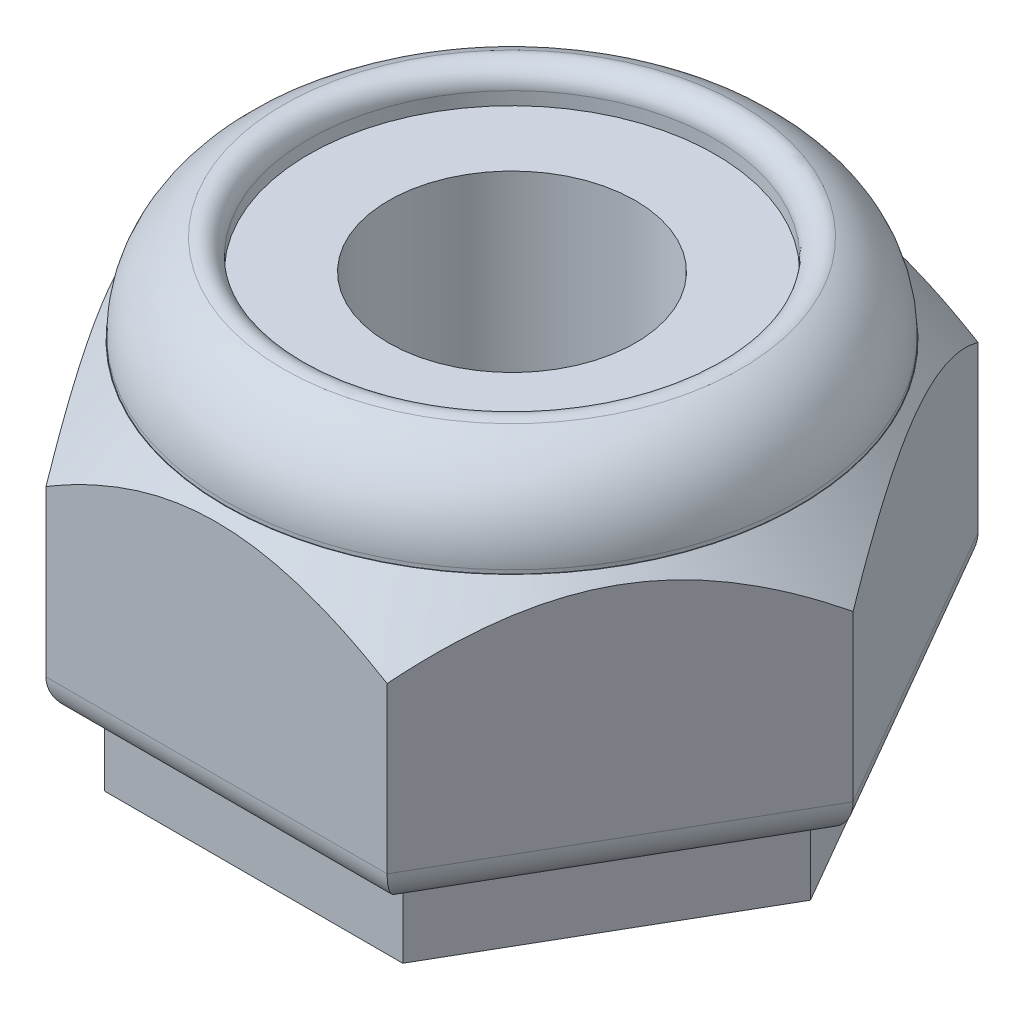
ISO-10303-21;
HEADER;
FILE_DESCRIPTION(('STEP AP214'),'2;1');
FILE_NAME('part.step','',(''),(''),'','','');
FILE_SCHEMA(('AUTOMOTIVE_DESIGN { 1 0 10303 214 1 1 1 1 }'));
ENDSEC;
DATA;
#1=APPLICATION_CONTEXT('core data for automotive mechanical design processes');
#2=APPLICATION_PROTOCOL_DEFINITION('international standard','automotive_design',2000,#1);
#3=PRODUCT_CONTEXT('',#1,'mechanical');
#4=PRODUCT('Part','Part','',(#3));
#5=PRODUCT_RELATED_PRODUCT_CATEGORY('part','',(#4));
#6=PRODUCT_DEFINITION_FORMATION('','',#4);
#7=PRODUCT_DEFINITION_CONTEXT('part definition',#1,'design');
#8=PRODUCT_DEFINITION('design','',#6,#7);
#9=PRODUCT_DEFINITION_SHAPE('','',#8);
#10=(LENGTH_UNIT() NAMED_UNIT(*) SI_UNIT(.MILLI.,.METRE.));
#11=(NAMED_UNIT(*) PLANE_ANGLE_UNIT() SI_UNIT($,.RADIAN.));
#12=(NAMED_UNIT(*) SI_UNIT($,.STERADIAN.) SOLID_ANGLE_UNIT());
#13=UNCERTAINTY_MEASURE_WITH_UNIT(LENGTH_MEASURE(1.E-05),#10,'distance_accuracy_value','');
#14=(GEOMETRIC_REPRESENTATION_CONTEXT(3) GLOBAL_UNCERTAINTY_ASSIGNED_CONTEXT((#13)) GLOBAL_UNIT_ASSIGNED_CONTEXT((#10,
#11,#12)) REPRESENTATION_CONTEXT('',''));
#15=CARTESIAN_POINT('',(0.,0.,0.));
#16=DIRECTION('',(0.,0.,1.));
#17=DIRECTION('',(1.,0.,0.));
#18=AXIS2_PLACEMENT_3D('',#15,#16,#17);
#19=CARTESIAN_POINT('',(0.,4.9784,0.));
#20=DIRECTION('',(0.,-1.,0.));
#21=DIRECTION('',(0.,0.,-1.));
#22=AXIS2_PLACEMENT_3D('',#19,#20,#21);
#23=CYLINDRICAL_SURFACE('',#22,3.937);
#24=CARTESIAN_POINT('',(0.,3.7084,0.));
#25=DIRECTION('',(0.,1.,0.));
#26=DIRECTION('',(-1.,0.,0.));
#27=AXIS2_PLACEMENT_3D('',#24,#25,#26);
#28=CIRCLE('',#27,3.937);
#29=CARTESIAN_POINT('',(-3.937,3.7084,0.));
#30=VERTEX_POINT('',#29);
#31=EDGE_CURVE('E142',#30,#30,#28,.T.);
#32=ORIENTED_EDGE('',*,*,#31,.F.);
#33=EDGE_LOOP('',(#32));
#34=FACE_BOUND('',#33,.T.);
#35=CARTESIAN_POINT('',(0.,3.6576,0.));
#36=DIRECTION('',(0.,-1.,0.));
#37=DIRECTION('',(0.,0.,-1.));
#38=AXIS2_PLACEMENT_3D('',#35,#36,#37);
#39=CIRCLE('',#38,3.937);
#40=CARTESIAN_POINT('',(0.,3.6576,-3.937));
#41=VERTEX_POINT('',#40);
#42=EDGE_CURVE('E20',#41,#41,#39,.F.);
#43=ORIENTED_EDGE('',*,*,#42,.T.);
#44=EDGE_LOOP('',(#43));
#45=FACE_BOUND('',#44,.T.);
#46=ADVANCED_FACE('F16',(#34,#45),#23,.T.);
#47=CARTESIAN_POINT('',(0.,3.7084,0.));
#48=DIRECTION('',(0.,1.,0.));
#49=DIRECTION('',(0.,0.,1.));
#50=AXIS2_PLACEMENT_3D('',#47,#48,#49);
#51=TOROIDAL_SURFACE('',#50,2.667,1.27);
#52=CARTESIAN_POINT('',(0.,4.88572150982674,0.));
#53=DIRECTION('',(0.,1.,0.));
#54=DIRECTION('',(0.,0.,1.));
#55=AXIS2_PLACEMENT_3D('',#52,#53,#54);
#56=CIRCLE('',#55,3.14325000000061);
#57=CARTESIAN_POINT('',(0.,4.88572150982674,3.14325000000061));
#58=VERTEX_POINT('',#57);
#59=EDGE_CURVE('E139',#58,#58,#56,.T.);
#60=ORIENTED_EDGE('',*,*,#59,.F.);
#61=EDGE_LOOP('',(#60));
#62=FACE_BOUND('',#61,.T.);
#63=ORIENTED_EDGE('',*,*,#31,.T.);
#64=EDGE_LOOP('',(#63));
#65=FACE_BOUND('',#64,.T.);
#66=ADVANCED_FACE('F520',(#62,#65),#51,.T.);
#67=CARTESIAN_POINT('',(2.34315,3.6576,4.05845484975428));
#68=DIRECTION('',(0.,-1.,0.));
#69=DIRECTION('',(0.,0.,-1.));
#70=AXIS2_PLACEMENT_3D('',#67,#68,#69);
#71=PLANE('',#70);
#72=CARTESIAN_POINT('',(0.,3.65760000016735,0.));
#73=DIRECTION('',(0.,-1.,0.));
#74=DIRECTION('',(0.,0.,-1.));
#75=AXIS2_PLACEMENT_3D('',#72,#73,#74);
#76=CIRCLE('',#75,3.94407100941407);
#77=CARTESIAN_POINT('',(0.,3.65760000016735,-3.94407100941407));
#78=VERTEX_POINT('',#77);
#79=EDGE_CURVE('E138',#78,#78,#76,.T.);
#80=ORIENTED_EDGE('',*,*,#79,.F.);
#81=EDGE_LOOP('',(#80));
#82=FACE_BOUND('',#81,.T.);
#83=ORIENTED_EDGE('',*,*,#42,.F.);
#84=EDGE_LOOP('',(#83));
#85=FACE_BOUND('',#84,.T.);
#86=ADVANCED_FACE('F202',(#82,#85),#71,.F.);
#87=CARTESIAN_POINT('',(0.,4.6502572078617,0.));
#88=DIRECTION('',(0.,-1.,0.));
#89=DIRECTION('',(0.,0.,-1.));
#90=AXIS2_PLACEMENT_3D('',#87,#88,#89);
#91=TOROIDAL_SURFACE('',#90,3.048,0.254);
#92=CARTESIAN_POINT('',(0.,4.6502572078617,0.));
#93=DIRECTION('',(0.,1.,0.));
#94=DIRECTION('',(0.,0.,1.));
#95=AXIS2_PLACEMENT_3D('',#92,#93,#94);
#96=CIRCLE('',#95,2.794);
#97=CARTESIAN_POINT('',(0.,4.6502572078617,2.794));
#98=VERTEX_POINT('',#97);
#99=EDGE_CURVE('E123',#98,#98,#96,.F.);
#100=ORIENTED_EDGE('',*,*,#99,.T.);
#101=EDGE_LOOP('',(#100));
#102=FACE_BOUND('',#101,.T.);
#103=ORIENTED_EDGE('',*,*,#59,.T.);
#104=EDGE_LOOP('',(#103));
#105=FACE_BOUND('',#104,.T.);
#106=ADVANCED_FACE('F18',(#102,#105),#91,.T.);
#107=CARTESIAN_POINT('',(0.,2.76773860963431,0.));
#108=DIRECTION('',(0.,-1.,0.));
#109=DIRECTION('',(0.,0.,-1.));
#110=AXIS2_PLACEMENT_3D('',#107,#108,#109);
#111=CONICAL_SURFACE('',#110,4.69075337389313,0.698131700721155);
#112=CARTESIAN_POINT('',(-4.68629999999348,2.77304593399523,3.18957668174363E-11));
#113=CARTESIAN_POINT('',(-4.65177717138756,2.81418235889058,0.0597952931853238));
#114=CARTESIAN_POINT('',(-4.61695780285874,2.85432113110325,0.120104208559187));
#115=CARTESIAN_POINT('',(-4.54666264439072,2.93230661020142,0.24185899454775));
#116=CARTESIAN_POINT('',(-4.51118655192888,2.97015222461229,0.30330538914701));
#117=CARTESIAN_POINT('',(-4.40329561885658,3.08018701499376,0.490177966906433));
#118=CARTESIAN_POINT('',(-4.32983334005873,3.1483701557544,0.617418366223026));
#119=CARTESIAN_POINT('',(-4.1797796500098,3.2709277860922,0.87731898125017));
#120=CARTESIAN_POINT('',(-4.10317943937247,3.32525984886838,1.00999443794479));
#121=CARTESIAN_POINT('',(-3.94747591658345,3.41577217647524,1.27968085033302));
#122=CARTESIAN_POINT('',(-3.8683799825187,3.45200143015516,1.4166790268052));
#123=CARTESIAN_POINT('',(-3.7374658520641,3.49372811247047,1.64342895218122));
#124=CARTESIAN_POINT('',(-3.68614686030726,3.50560413719466,1.73231605329728));
#125=CARTESIAN_POINT('',(-3.58316406721768,3.5200814070843,1.91068748323378));
#126=CARTESIAN_POINT('',(-3.53150020848239,3.52268106759525,2.00017191147836));
#127=CARTESIAN_POINT('',(-3.42855034567204,3.51847006533028,2.17848630449813));
#128=CARTESIAN_POINT('',(-3.37726380902314,3.51171021127555,2.26731719171826));
#129=CARTESIAN_POINT('',(-3.27519197727788,3.48921023566831,2.44411079032266));
#130=CARTESIAN_POINT('',(-3.22440670734793,3.47346966554293,2.53207345811744));
#131=CARTESIAN_POINT('',(-3.10963060157119,3.42817062237776,2.73087150481763));
#132=CARTESIAN_POINT('',(-3.04589899601755,3.39598542093892,2.84125788368448));
#133=CARTESIAN_POINT('',(-2.9201816676812,3.32004827868638,3.05900668375484));
#134=CARTESIAN_POINT('',(-2.85819691992543,3.27629001439926,3.16636741616216));
#135=CARTESIAN_POINT('',(-2.73588906863866,3.17910361417006,3.37821082875542));
#136=CARTESIAN_POINT('',(-2.67557364773969,3.12563730764652,3.48268020223234));
#137=CARTESIAN_POINT('',(-2.55683004359766,3.01104764647452,3.68835015768017));
#138=CARTESIAN_POINT('',(-2.49840123130636,2.94992687790312,3.78955182919461));
#139=CARTESIAN_POINT('',(-2.42439626128615,2.86741854661881,3.91773219728221));
#140=CARTESIAN_POINT('',(-2.40802320136185,2.84883596678226,3.94609116894647));
#141=CARTESIAN_POINT('',(-2.37546215779885,2.81125673922143,4.00248855074505));
#142=CARTESIAN_POINT('',(-2.35927376452174,2.79226151168798,4.0305276703939));
#143=CARTESIAN_POINT('',(-2.34315000001498,2.77304593398948,4.05845484972889));
#144=B_SPLINE_CURVE_WITH_KNOTS('',3,(#112,#113,#114,#115,#116,#117,#118,#119,#120,#121,#122,
#123,#124,#125,#126,#127,#128,#129,#130,#131,#132,#133,#134,#135,#136,#137,#138,#139,#140,#141,
#142,#143),.UNSPECIFIED.,.F.,.F.,(4,2,2,2,2,2,2,2,2,2,2,2,2,2,2,4),(0.,0.241096809056246,
0.482307589388012,0.967637153718468,1.45443592224084,1.93991010932418,2.24950193403327,
2.55914664288794,2.86711700029536,3.17510274169198,3.56882084650594,3.96275452329456,
4.35827201843946,4.75365624579551,4.86660838927403,4.97921936893793),.UNSPECIFIED.);
#145=CARTESIAN_POINT('',(-4.68629999998375,2.7730459339908,9.37515399375441E-13));
#146=VERTEX_POINT('',#145);
#147=CARTESIAN_POINT('',(-2.34314999998652,2.77304593399338,4.05845484974154));
#148=VERTEX_POINT('',#147);
#149=EDGE_CURVE('E111',#146,#148,#144,.T.);
#150=ORIENTED_EDGE('',*,*,#149,.T.);
#151=CARTESIAN_POINT('',(-2.343149999958,2.77304593399722,4.05845484975428));
#152=CARTESIAN_POINT('',(-2.27415972161835,2.81414935271739,4.05845484975427));
#153=CARTESIAN_POINT('',(-2.20457738514571,2.85425669884828,4.05845484975427));
#154=CARTESIAN_POINT('',(-2.06410193522936,2.93218331967992,4.05845484975429));
#155=CARTESIAN_POINT('',(-1.99320821637204,2.97000150131172,4.05845484975429));
#156=CARTESIAN_POINT('',(-1.77754688772133,3.07999086386102,4.05845484975426));
#157=CARTESIAN_POINT('',(-1.63068545872083,3.14815894036669,4.05845484975416));
#158=CARTESIAN_POINT('',(-1.33052752464912,3.27077676919254,4.0584548497544));
#159=CARTESIAN_POINT('',(-1.17720631618685,3.32516696804563,4.05845484975474));
#160=CARTESIAN_POINT('',(-0.865613503948554,3.4157460876751,4.05845484975382));
#161=CARTESIAN_POINT('',(-0.70735922947609,3.45199244877055,4.05845484975257));
#162=CARTESIAN_POINT('',(-0.45682214350177,3.49192146551217,4.05845484975525));
#163=CARTESIAN_POINT('',(-0.365672921281911,3.50290887300896,4.05845484975717));
#164=CARTESIAN_POINT('',(-0.183016322067624,3.51758027920104,4.0584548497514));
#165=CARTESIAN_POINT('',(-0.0915105175566495,3.52128341043656,4.05845484974374));
#166=CARTESIAN_POINT('',(0.104649468646223,3.52128177498337,4.05845484974251));
#167=CARTESIAN_POINT('',(0.209305100881576,3.51643705340262,4.05845484975112));
#168=CARTESIAN_POINT('',(0.417787181928433,3.49730239566488,4.05845484975744));
#169=CARTESIAN_POINT('',(0.521613181375682,3.48300765117544,4.05845484975513));
#170=CARTESIAN_POINT('',(0.72833254494445,3.44553375891179,4.05845484975343));
#171=CARTESIAN_POINT('',(0.831215331593288,3.42229697728581,4.05845484975405));
#172=CARTESIAN_POINT('',(1.03487580395276,3.36791830057797,4.05845484975451));
#173=CARTESIAN_POINT('',(1.13565289473255,3.33677420324107,4.05845484975434));
#174=CARTESIAN_POINT('',(1.33273383825789,3.26838741919357,4.05845484975422));
#175=CARTESIAN_POINT('',(1.42908716228577,3.23128582685647,4.05845484975426));
#176=CARTESIAN_POINT('',(1.61947291708668,3.15151071592509,4.05845484975429));
#177=CARTESIAN_POINT('',(1.71350470709066,3.10883567899735,4.05845484975428));
#178=CARTESIAN_POINT('',(1.89803195379429,3.01941532331672,4.05845484975428));
#179=CARTESIAN_POINT('',(1.98855798042342,2.9727325572595,4.05845484975428));
#180=CARTESIAN_POINT('',(2.1674283495183,2.87556944084182,4.05845484975428));
#181=CARTESIAN_POINT('',(2.25577492885003,2.82509321931918,4.05845484975428));
#182=CARTESIAN_POINT('',(2.34314999996995,2.7730459339901,4.05845484975428));
#183=B_SPLINE_CURVE_WITH_KNOTS('',3,(#151,#152,#153,#154,#155,#156,#157,#158,#159,#160,#161,
#162,#163,#164,#165,#166,#167,#168,#169,#170,#171,#172,#173,#174,#175,#176,#177,#178,#179,#180,
#181,#182),.UNSPECIFIED.,.F.,.F.,(4,2,2,2,2,2,2,2,2,2,2,2,2,2,2,4),(0.,0.240903303526745,
0.481920744670744,0.96705946683683,1.45426068355447,1.93990959151276,2.21507934679439,
2.48952538382514,2.8033759959097,3.11738642356324,3.43345557969817,3.74961286054327,
4.05916118103305,4.36879400613619,4.67425708536422,4.9793923805577),.UNSPECIFIED.);
#184=CARTESIAN_POINT('',(2.3431499999929,2.77304593399127,4.0584548497399));
#185=VERTEX_POINT('',#184);
#186=EDGE_CURVE('E103',#148,#185,#183,.T.);
#187=ORIENTED_EDGE('',*,*,#186,.T.);
#188=CARTESIAN_POINT('',(2.34315000002452,2.77304593399606,4.05845484973288));
#189=CARTESIAN_POINT('',(2.37767282861905,2.81418235889133,3.99865955657287));
#190=CARTESIAN_POINT('',(2.41249219714304,2.85432113110396,3.93835064119622));
#191=CARTESIAN_POINT('',(2.4827873556074,2.93230661020207,3.81659585520557));
#192=CARTESIAN_POINT('',(2.51826344807041,2.97015222461292,3.75514946060702));
#193=CARTESIAN_POINT('',(2.6261543811446,3.08018701499436,3.56827688284876));
#194=CARTESIAN_POINT('',(2.6996166599415,3.14837015575496,3.44103648353166));
#195=CARTESIAN_POINT('',(2.8496703499897,3.27092778609269,3.18113586850418));
#196=CARTESIAN_POINT('',(2.92627056062726,3.32525984886884,3.04846041180975));
#197=CARTESIAN_POINT('',(3.08197408341642,3.41577217647565,2.7787739994217));
#198=CARTESIAN_POINT('',(3.16107001748108,3.45200143015555,2.64177582294952));
#199=CARTESIAN_POINT('',(3.29198414793562,3.49372811247083,2.41502589757353));
#200=CARTESIAN_POINT('',(3.34330313969246,3.50560413719502,2.32613879645748));
#201=CARTESIAN_POINT('',(3.44628593278203,3.52008140708464,2.147767366521));
#202=CARTESIAN_POINT('',(3.49794979151732,3.52268106759558,2.05828293827642));
#203=CARTESIAN_POINT('',(3.60089965432767,3.5184700653306,1.87996854525667));
#204=CARTESIAN_POINT('',(3.65218619097656,3.51171021127586,1.79113765803655));
#205=CARTESIAN_POINT('',(3.75425802272181,3.48921023566861,1.61434405943216));
#206=CARTESIAN_POINT('',(3.80504329265176,3.47346966554323,1.52638139163739));
#207=CARTESIAN_POINT('',(3.91981939842849,3.42817062237805,1.32758334493721));
#208=CARTESIAN_POINT('',(3.98355100398213,3.3959854209392,1.21719696607035));
#209=CARTESIAN_POINT('',(4.10926833231848,3.32004827868664,0.999448165999992));
#210=CARTESIAN_POINT('',(4.17125308007425,3.27629001439952,0.892087433592668));
#211=CARTESIAN_POINT('',(4.29356093136102,3.1791036141703,0.680244020999412));
#212=CARTESIAN_POINT('',(4.35387635225999,3.12563730764676,0.575774647522495));
#213=CARTESIAN_POINT('',(4.47261995640202,3.01104764647474,0.37010469207467));
#214=CARTESIAN_POINT('',(4.53104876869332,2.94992687790334,0.268903020560232));
#215=CARTESIAN_POINT('',(4.60505373871337,2.86741854661919,0.140722652472905));
#216=CARTESIAN_POINT('',(4.62142679863752,2.84883596678282,0.112363680808909));
#217=CARTESIAN_POINT('',(4.65398784220021,2.81125673922235,0.0559662990108572));
#218=CARTESIAN_POINT('',(4.67017623547717,2.79226151168908,0.0279271793622662));
#219=CARTESIAN_POINT('',(4.68629999998378,2.77304593399077,2.75383844447389E-11));
#220=B_SPLINE_CURVE_WITH_KNOTS('',3,(#188,#189,#190,#191,#192,#193,#194,#195,#196,#197,#198,
#199,#200,#201,#202,#203,#204,#205,#206,#207,#208,#209,#210,#211,#212,#213,#214,#215,#216,#217,
#218,#219),.UNSPECIFIED.,.F.,.F.,(4,2,2,2,2,2,2,2,2,2,2,2,2,2,2,4),(0.,0.241096809056167,
0.482307589387856,0.967637153718162,1.45443592224038,1.93991010932357,2.24950193403264,
2.55914664288729,2.86711700029468,3.17510274169127,3.56882084650524,3.96275452329387,
4.35827201843878,4.75365624579483,4.86660838927228,4.97921936893513),.UNSPECIFIED.);
#221=CARTESIAN_POINT('',(4.68629999999161,2.77304593398144,1.33689115351009E-11));
#222=VERTEX_POINT('',#221);
#223=EDGE_CURVE('E108',#185,#222,#220,.T.);
#224=ORIENTED_EDGE('',*,*,#223,.T.);
#225=CARTESIAN_POINT('',(4.68629999999319,2.77304593399505,-3.17196911331046E-11));
#226=CARTESIAN_POINT('',(4.65177717138749,2.81418235889048,-0.0597952931852118));
#227=CARTESIAN_POINT('',(4.61695780285875,2.85432113110319,-0.120104208559102));
#228=CARTESIAN_POINT('',(4.54666264439079,2.93230661020138,-0.241858994547681));
#229=CARTESIAN_POINT('',(4.51118655192894,2.97015222461224,-0.303305389146933));
#230=CARTESIAN_POINT('',(4.40329561885661,3.0801870149937,-0.490177966906337));
#231=CARTESIAN_POINT('',(4.32983334005878,3.14837015575435,-0.617418366222931));
#232=CARTESIAN_POINT('',(4.17977965000986,3.27092778609215,-0.877318981250067));
#233=CARTESIAN_POINT('',(4.10317943937253,3.32525984886834,-1.00999443794468));
#234=CARTESIAN_POINT('',(3.94747591658352,3.41577217647521,-1.27968085033289));
#235=CARTESIAN_POINT('',(3.86837998251877,3.45200143015513,-1.41667902680507));
#236=CARTESIAN_POINT('',(3.73746585206418,3.49372811247045,-1.64342895218108));
#237=CARTESIAN_POINT('',(3.68614686030734,3.50560413719465,-1.73231605329714));
#238=CARTESIAN_POINT('',(3.58316406721777,3.52008140708429,-1.91068748323363));
#239=CARTESIAN_POINT('',(3.53150020848248,3.52268106759524,-2.00017191147821));
#240=CARTESIAN_POINT('',(3.42855034567212,3.51847006533029,-2.17848630449798));
#241=CARTESIAN_POINT('',(3.37726380902323,3.51171021127556,-2.2673171917181));
#242=CARTESIAN_POINT('',(3.27519197727797,3.48921023566833,-2.4441107903225));
#243=CARTESIAN_POINT('',(3.22440670734802,3.47346966554296,-2.53207345811728));
#244=CARTESIAN_POINT('',(3.10963060157129,3.4281706223778,-2.73087150481746));
#245=CARTESIAN_POINT('',(3.04589899601765,3.39598542093897,-2.84125788368431));
#246=CARTESIAN_POINT('',(2.92018166768131,3.32004827868645,-3.05900668375466));
#247=CARTESIAN_POINT('',(2.85819691992554,3.27629001439934,-3.16636741616197));
#248=CARTESIAN_POINT('',(2.73588906863878,3.17910361417016,-3.37821082875522));
#249=CARTESIAN_POINT('',(2.67557364773981,3.12563730764663,-3.48268020223213));
#250=CARTESIAN_POINT('',(2.55683004359779,3.01104764647465,-3.68835015767995));
#251=CARTESIAN_POINT('',(2.49840123130649,2.94992687790326,-3.78955182919438));
#252=CARTESIAN_POINT('',(2.42439626128638,2.86741854661906,-3.91773219728182));
#253=CARTESIAN_POINT('',(2.40802320136216,2.84883596678261,-3.94609116894593));
#254=CARTESIAN_POINT('',(2.37546215779933,2.81125673922199,-4.00248855074421));
#255=CARTESIAN_POINT('',(2.35927376452231,2.79226151168865,-4.03052767039292));
#256=CARTESIAN_POINT('',(2.34315000001563,2.77304593399026,-4.05845484972776));
#257=B_SPLINE_CURVE_WITH_KNOTS('',3,(#225,#226,#227,#228,#229,#230,#231,#232,#233,#234,#235,
#236,#237,#238,#239,#240,#241,#242,#243,#244,#245,#246,#247,#248,#249,#250,#251,#252,#253,#254,
#255,#256),.UNSPECIFIED.,.F.,.F.,(4,2,2,2,2,2,2,2,2,2,2,2,2,2,2,4),(0.,0.241096809056242,
0.482307589388003,0.967637153718443,1.45443592224079,1.93991010932412,2.2495019340332,
2.55914664288787,2.86711700029528,3.17510274169189,3.56882084650582,3.96275452329442,
4.35827201843928,4.7536562457953,4.86660838927321,4.97921936893651),.UNSPECIFIED.);
#258=CARTESIAN_POINT('',(2.34314999999134,2.77304593399109,-4.05845484974097));
#259=VERTEX_POINT('',#258);
#260=EDGE_CURVE('E180',#222,#259,#257,.T.);
#261=ORIENTED_EDGE('',*,*,#260,.T.);
#262=CARTESIAN_POINT('',(2.34314999996944,2.77304593399595,-4.05845484976487));
#263=CARTESIAN_POINT('',(2.27415972162791,2.81414935271385,-4.05845484975817));
#264=CARTESIAN_POINT('',(2.20457738515427,2.85425669884398,-4.05845484975534));
#265=CARTESIAN_POINT('',(2.06410193523665,2.93218331967544,-4.05845484975322));
#266=CARTESIAN_POINT('',(1.99320821637908,2.97000150130784,-4.05845484975392));
#267=CARTESIAN_POINT('',(1.77754688772728,3.07999086385858,-4.05845484975501));
#268=CARTESIAN_POINT('',(1.63068545872571,3.14815894036465,-4.05845484975436));
#269=CARTESIAN_POINT('',(1.33052752465186,3.27077676919147,-4.0584548497542));
#270=CARTESIAN_POINT('',(1.1772063161885,3.32516696804511,-4.05845484975469));
#271=CARTESIAN_POINT('',(0.865613503947962,3.41574608767532,-4.05845484975387));
#272=CARTESIAN_POINT('',(0.707359229474328,3.45199244877097,-4.05845484975258));
#273=CARTESIAN_POINT('',(0.456822143499305,3.49192146551248,-4.05845484975524));
#274=CARTESIAN_POINT('',(0.365672921279934,3.50290887300915,-4.05845484975717));
#275=CARTESIAN_POINT('',(0.183016322066631,3.51758027920108,-4.0584548497514));
#276=CARTESIAN_POINT('',(0.0915105175561532,3.52128341043657,-4.05845484974374));
#277=CARTESIAN_POINT('',(-0.104649468646221,3.52128177498337,-4.05845484974251));
#278=CARTESIAN_POINT('',(-0.209305100881572,3.51643705340262,-4.05845484975112));
#279=CARTESIAN_POINT('',(-0.417787181928427,3.49730239566488,-4.05845484975744));
#280=CARTESIAN_POINT('',(-0.521613181375675,3.48300765117544,-4.05845484975513));
#281=CARTESIAN_POINT('',(-0.728332544944443,3.44553375891179,-4.05845484975343));
#282=CARTESIAN_POINT('',(-0.831215331593282,3.42229697728581,-4.05845484975405));
#283=CARTESIAN_POINT('',(-1.03487580395276,3.36791830057797,-4.05845484975451));
#284=CARTESIAN_POINT('',(-1.13565289473255,3.33677420324107,-4.05845484975434));
#285=CARTESIAN_POINT('',(-1.33273383825789,3.26838741919357,-4.05845484975422));
#286=CARTESIAN_POINT('',(-1.42908716228577,3.23128582685647,-4.05845484975426));
#287=CARTESIAN_POINT('',(-1.61947291708668,3.15151071592509,-4.05845484975429));
#288=CARTESIAN_POINT('',(-1.71350470709067,3.10883567899735,-4.05845484975428));
#289=CARTESIAN_POINT('',(-1.8980319537943,3.01941532331672,-4.05845484975428));
#290=CARTESIAN_POINT('',(-1.98855798042343,2.9727325572595,-4.05845484975428));
#291=CARTESIAN_POINT('',(-2.1674283495183,2.87556944084182,-4.05845484975428));
#292=CARTESIAN_POINT('',(-2.25577492885003,2.82509321931918,-4.05845484975428));
#293=CARTESIAN_POINT('',(-2.34314999996995,2.7730459339901,-4.05845484975428));
#294=B_SPLINE_CURVE_WITH_KNOTS('',3,(#262,#263,#264,#265,#266,#267,#268,#269,#270,#271,#272,
#273,#274,#275,#276,#277,#278,#279,#280,#281,#282,#283,#284,#285,#286,#287,#288,#289,#290,#291,
#292,#293),.UNSPECIFIED.,.F.,.F.,(4,2,2,2,2,2,2,2,2,2,2,2,2,2,2,4),(0.,0.24090330352822,
0.481920744673772,0.967059466843218,1.45426068356448,1.93990959152627,2.21507934680641,
2.48952538383567,2.80337599592023,3.11738642357377,3.4334555797087,3.7496128605538,
4.05916118104359,4.36879400614674,4.67425708537477,4.97939238056824),.UNSPECIFIED.);
#295=CARTESIAN_POINT('',(-2.3431499999929,2.77304593399127,-4.0584548497399));
#296=VERTEX_POINT('',#295);
#297=EDGE_CURVE('E187',#259,#296,#294,.T.);
#298=ORIENTED_EDGE('',*,*,#297,.T.);
#299=CARTESIAN_POINT('',(-2.34315000002452,2.77304593399606,-4.05845484973288));
#300=CARTESIAN_POINT('',(-2.37767282861905,2.81418235889133,-3.99865955657287));
#301=CARTESIAN_POINT('',(-2.41249219714304,2.85432113110396,-3.93835064119622));
#302=CARTESIAN_POINT('',(-2.4827873556074,2.93230661020207,-3.81659585520557));
#303=CARTESIAN_POINT('',(-2.51826344807041,2.97015222461292,-3.75514946060702));
#304=CARTESIAN_POINT('',(-2.6261543811446,3.08018701499436,-3.56827688284876));
#305=CARTESIAN_POINT('',(-2.6996166599415,3.14837015575496,-3.44103648353166));
#306=CARTESIAN_POINT('',(-2.8496703499897,3.27092778609269,-3.18113586850418));
#307=CARTESIAN_POINT('',(-2.92627056062726,3.32525984886884,-3.04846041180975));
#308=CARTESIAN_POINT('',(-3.08197408341642,3.41577217647565,-2.7787739994217));
#309=CARTESIAN_POINT('',(-3.16107001748107,3.45200143015555,-2.64177582294952));
#310=CARTESIAN_POINT('',(-3.29198414793562,3.49372811247083,-2.41502589757353));
#311=CARTESIAN_POINT('',(-3.34330313969246,3.50560413719501,-2.32613879645748));
#312=CARTESIAN_POINT('',(-3.44628593278203,3.52008140708464,-2.147767366521));
#313=CARTESIAN_POINT('',(-3.49794979151732,3.52268106759558,-2.05828293827642));
#314=CARTESIAN_POINT('',(-3.60089965432767,3.5184700653306,-1.87996854525667));
#315=CARTESIAN_POINT('',(-3.65218619097656,3.51171021127586,-1.79113765803655));
#316=CARTESIAN_POINT('',(-3.75425802272181,3.48921023566861,-1.61434405943216));
#317=CARTESIAN_POINT('',(-3.80504329265176,3.47346966554323,-1.52638139163739));
#318=CARTESIAN_POINT('',(-3.91981939842849,3.42817062237805,-1.32758334493721));
#319=CARTESIAN_POINT('',(-3.98355100398213,3.3959854209392,-1.21719696607035));
#320=CARTESIAN_POINT('',(-4.10926833231848,3.32004827868664,-0.999448165999994));
#321=CARTESIAN_POINT('',(-4.17125308007425,3.27629001439952,-0.89208743359267));
#322=CARTESIAN_POINT('',(-4.29356093136102,3.1791036141703,-0.680244020999414));
#323=CARTESIAN_POINT('',(-4.35387635225999,3.12563730764676,-0.575774647522497));
#324=CARTESIAN_POINT('',(-4.47261995640202,3.01104764647475,-0.370104692074671));
#325=CARTESIAN_POINT('',(-4.53104876869332,2.94992687790334,-0.268903020560233));
#326=CARTESIAN_POINT('',(-4.60505373871344,2.86741854661911,-0.140722652472786));
#327=CARTESIAN_POINT('',(-4.62142679863765,2.84883596678266,-0.11236368080867));
#328=CARTESIAN_POINT('',(-4.65398784220049,2.81125673922203,-0.0559662990103821));
#329=CARTESIAN_POINT('',(-4.67017623547751,2.79226151168868,-0.0279271793616742));
#330=CARTESIAN_POINT('',(-4.68629999998419,2.77304593399028,-2.68308419213501E-11));
#331=B_SPLINE_CURVE_WITH_KNOTS('',3,(#299,#300,#301,#302,#303,#304,#305,#306,#307,#308,#309,
#310,#311,#312,#313,#314,#315,#316,#317,#318,#319,#320,#321,#322,#323,#324,#325,#326,#327,#328,
#329,#330),.UNSPECIFIED.,.F.,.F.,(4,2,2,2,2,2,2,2,2,2,2,2,2,2,2,4),(0.,0.241096809056167,
0.482307589387856,0.967637153718161,1.45443592224038,1.93991010932357,2.24950193403263,
2.55914664288729,2.86711700029468,3.17510274169127,3.56882084650524,3.96275452329387,
4.35827201843878,4.75365624579483,4.86660838927276,4.97921936893608),.UNSPECIFIED.);
#332=EDGE_CURVE('E212',#296,#146,#331,.T.);
#333=ORIENTED_EDGE('',*,*,#332,.T.);
#334=EDGE_LOOP('',(#150,#187,#224,#261,#298,#333));
#335=FACE_BOUND('',#334,.T.);
#336=ORIENTED_EDGE('',*,*,#79,.T.);
#337=EDGE_LOOP('',(#336));
#338=FACE_BOUND('',#337,.T.);
#339=ADVANCED_FACE('F105',(#335,#338),#111,.T.);
#340=CARTESIAN_POINT('',(0.,4.4704,0.));
#341=DIRECTION('',(0.,1.,0.));
#342=DIRECTION('',(0.,0.,1.));
#343=AXIS2_PLACEMENT_3D('',#340,#341,#342);
#344=CYLINDRICAL_SURFACE('',#343,2.794);
#345=ORIENTED_EDGE('',*,*,#99,.F.);
#346=EDGE_LOOP('',(#345));
#347=FACE_BOUND('',#346,.T.);
#348=CARTESIAN_POINT('',(0.,4.4704,0.));
#349=DIRECTION('',(0.,1.,0.));
#350=DIRECTION('',(0.,0.,1.));
#351=AXIS2_PLACEMENT_3D('',#348,#349,#350);
#352=CIRCLE('',#351,2.794);
#353=CARTESIAN_POINT('',(0.,4.4704,2.794));
#354=VERTEX_POINT('',#353);
#355=EDGE_CURVE('E176',#354,#354,#352,.T.);
#356=ORIENTED_EDGE('',*,*,#355,.F.);
#357=EDGE_LOOP('',(#356));
#358=FACE_BOUND('',#357,.T.);
#359=ADVANCED_FACE('F200',(#347,#358),#344,.F.);
#360=CARTESIAN_POINT('',(2.34315,3.6576,4.05845484975428));
#361=DIRECTION('',(-0.866025403784429,0.,-0.500000000000017));
#362=DIRECTION('',(-0.500000000000017,0.,0.866025403784429));
#363=AXIS2_PLACEMENT_3D('',#360,#361,#362);
#364=PLANE('',#363);
#365=DIRECTION('',(0.,1.,0.));
#366=VECTOR('',#365,1.);
#367=CARTESIAN_POINT('',(4.68629999999948,3.6576,-8.94818667933482E-13));
#368=LINE('',#367,#366);
#369=CARTESIAN_POINT('',(4.68629999999966,0.508,-2.24528612157613E-13));
#370=VERTEX_POINT('',#369);
#371=EDGE_CURVE('E121',#370,#222,#368,.T.);
#372=ORIENTED_EDGE('',*,*,#371,.T.);
#373=ORIENTED_EDGE('',*,*,#223,.F.);
#374=DIRECTION('',(0.,1.,0.));
#375=VECTOR('',#374,1.);
#376=CARTESIAN_POINT('',(2.34315000000748,3.6576,4.05845484975428));
#377=LINE('',#376,#375);
#378=CARTESIAN_POINT('',(2.34315000000398,0.508,4.05845484975428));
#379=VERTEX_POINT('',#378);
#380=EDGE_CURVE('E115',#185,#379,#377,.F.);
#381=ORIENTED_EDGE('',*,*,#380,.T.);
#382=DIRECTION('',(-0.500000000000017,0.,0.866025403784429));
#383=VECTOR('',#382,1.);
#384=CARTESIAN_POINT('',(2.34315000000047,0.508,4.05845484975429));
#385=LINE('',#384,#383);
#386=EDGE_CURVE('E175',#370,#379,#385,.T.);
#387=ORIENTED_EDGE('',*,*,#386,.F.);
#388=EDGE_LOOP('',(#372,#373,#381,#387));
#389=FACE_BOUND('',#388,.T.);
#390=ADVANCED_FACE('F118',(#389),#364,.F.);
#391=CARTESIAN_POINT('',(-2.34315,3.6576,4.05845484975428));
#392=DIRECTION('',(0.,0.,-1.));
#393=DIRECTION('',(-1.,0.,0.));
#394=AXIS2_PLACEMENT_3D('',#391,#392,#393);
#395=PLANE('',#394);
#396=ORIENTED_EDGE('',*,*,#380,.F.);
#397=ORIENTED_EDGE('',*,*,#186,.F.);
#398=DIRECTION('',(0.,1.,0.));
#399=VECTOR('',#398,1.);
#400=CARTESIAN_POINT('',(-2.34314999999321,3.6576,4.0584548497666));
#401=LINE('',#400,#399);
#402=CARTESIAN_POINT('',(-2.34314999999657,0.508,4.05845484976041));
#403=VERTEX_POINT('',#402);
#404=EDGE_CURVE('E131',#148,#403,#401,.F.);
#405=ORIENTED_EDGE('',*,*,#404,.T.);
#406=DIRECTION('',(-1.,0.,0.));
#407=VECTOR('',#406,1.);
#408=CARTESIAN_POINT('',(-2.34315,0.508,4.05845484975428));
#409=LINE('',#408,#407);
#410=EDGE_CURVE('E128',#379,#403,#409,.T.);
#411=ORIENTED_EDGE('',*,*,#410,.F.);
#412=EDGE_LOOP('',(#396,#397,#405,#411));
#413=FACE_BOUND('',#412,.T.);
#414=ADVANCED_FACE('F126',(#413),#395,.F.);
#415=CARTESIAN_POINT('',(-4.6863,3.6576,0.));
#416=DIRECTION('',(0.866025403784429,0.,-0.500000000000017));
#417=DIRECTION('',(-0.500000000000017,0.,-0.866025403784429));
#418=AXIS2_PLACEMENT_3D('',#415,#416,#417);
#419=PLANE('',#418);
#420=ORIENTED_EDGE('',*,*,#404,.F.);
#421=ORIENTED_EDGE('',*,*,#149,.F.);
#422=DIRECTION('',(0.,1.,0.));
#423=VECTOR('',#422,1.);
#424=CARTESIAN_POINT('',(-4.68630000000314,3.6576,5.99607169471383E-12));
#425=LINE('',#424,#423);
#426=CARTESIAN_POINT('',(-4.68630000000163,0.508,2.75502548292145E-12));
#427=VERTEX_POINT('',#426);
#428=EDGE_CURVE('E328',#146,#427,#425,.F.);
#429=ORIENTED_EDGE('',*,*,#428,.T.);
#430=DIRECTION('',(-0.500000000000017,0.,-0.866025403784429));
#431=VECTOR('',#430,1.);
#432=CARTESIAN_POINT('',(-4.68629999999971,0.508,0.));
#433=LINE('',#432,#431);
#434=EDGE_CURVE('E169',#403,#427,#433,.T.);
#435=ORIENTED_EDGE('',*,*,#434,.F.);
#436=EDGE_LOOP('',(#420,#421,#429,#435));
#437=FACE_BOUND('',#436,.T.);
#438=ADVANCED_FACE('F225',(#437),#419,.F.);
#439=CARTESIAN_POINT('',(-2.34315,3.6576,-4.05845484975428));
#440=DIRECTION('',(0.866025403784429,0.,0.500000000000017));
#441=DIRECTION('',(0.500000000000017,0.,-0.866025403784429));
#442=AXIS2_PLACEMENT_3D('',#439,#440,#441);
#443=PLANE('',#442);
#444=ORIENTED_EDGE('',*,*,#428,.F.);
#445=ORIENTED_EDGE('',*,*,#332,.F.);
#446=DIRECTION('',(0.,1.,0.));
#447=VECTOR('',#446,1.);
#448=CARTESIAN_POINT('',(-2.34315000000748,3.6576,-4.05845484975428));
#449=LINE('',#448,#447);
#450=CARTESIAN_POINT('',(-2.34315000000398,0.508,-4.05845484975428));
#451=VERTEX_POINT('',#450);
#452=EDGE_CURVE('E327',#296,#451,#449,.F.);
#453=ORIENTED_EDGE('',*,*,#452,.T.);
#454=DIRECTION('',(0.500000000000017,0.,-0.866025403784429));
#455=VECTOR('',#454,1.);
#456=CARTESIAN_POINT('',(-2.34315000000047,0.508,-4.05845484975429));
#457=LINE('',#456,#455);
#458=EDGE_CURVE('E165',#427,#451,#457,.T.);
#459=ORIENTED_EDGE('',*,*,#458,.F.);
#460=EDGE_LOOP('',(#444,#445,#453,#459));
#461=FACE_BOUND('',#460,.T.);
#462=ADVANCED_FACE('F228',(#461),#443,.F.);
#463=CARTESIAN_POINT('',(2.34315,3.6576,-4.05845484975428));
#464=DIRECTION('',(0.,0.,1.));
#465=DIRECTION('',(1.,0.,0.));
#466=AXIS2_PLACEMENT_3D('',#463,#464,#465);
#467=PLANE('',#466);
#468=ORIENTED_EDGE('',*,*,#452,.F.);
#469=ORIENTED_EDGE('',*,*,#297,.F.);
#470=DIRECTION('',(0.,1.,0.));
#471=VECTOR('',#470,1.);
#472=CARTESIAN_POINT('',(2.3431499999965,3.6576,-4.05845484976089));
#473=LINE('',#472,#471);
#474=CARTESIAN_POINT('',(2.34314999999821,0.508,-4.05845484975756));
#475=VERTEX_POINT('',#474);
#476=EDGE_CURVE('E179',#259,#475,#473,.F.);
#477=ORIENTED_EDGE('',*,*,#476,.T.);
#478=DIRECTION('',(1.,0.,0.));
#479=VECTOR('',#478,1.);
#480=CARTESIAN_POINT('',(2.34315,0.508,-4.05845484975428));
#481=LINE('',#480,#479);
#482=EDGE_CURVE('E161',#451,#475,#481,.T.);
#483=ORIENTED_EDGE('',*,*,#482,.F.);
#484=EDGE_LOOP('',(#468,#469,#477,#483));
#485=FACE_BOUND('',#484,.T.);
#486=ADVANCED_FACE('F305',(#485),#467,.F.);
#487=CARTESIAN_POINT('',(4.6863,3.6576,0.));
#488=DIRECTION('',(-0.866025403784429,0.,0.500000000000017));
#489=DIRECTION('',(0.500000000000017,0.,0.866025403784429));
#490=AXIS2_PLACEMENT_3D('',#487,#488,#489);
#491=PLANE('',#490);
#492=ORIENTED_EDGE('',*,*,#476,.F.);
#493=ORIENTED_EDGE('',*,*,#260,.F.);
#494=ORIENTED_EDGE('',*,*,#371,.F.);
#495=DIRECTION('',(0.500000000000017,0.,0.866025403784429));
#496=VECTOR('',#495,1.);
#497=CARTESIAN_POINT('',(4.68629999999971,0.508,0.));
#498=LINE('',#497,#496);
#499=EDGE_CURVE('E157',#475,#370,#498,.T.);
#500=ORIENTED_EDGE('',*,*,#499,.F.);
#501=EDGE_LOOP('',(#492,#493,#494,#500));
#502=FACE_BOUND('',#501,.T.);
#503=ADVANCED_FACE('F193',(#502),#491,.F.);
#504=CARTESIAN_POINT('',(0.,4.4704,0.));
#505=DIRECTION('',(0.,1.,0.));
#506=DIRECTION('',(0.,0.,1.));
#507=AXIS2_PLACEMENT_3D('',#504,#505,#506);
#508=PLANE('',#507);
#509=ORIENTED_EDGE('',*,*,#355,.T.);
#510=EDGE_LOOP('',(#509));
#511=FACE_BOUND('',#510,.T.);
#512=CARTESIAN_POINT('',(0.,4.4704,0.));
#513=DIRECTION('',(0.,1.,0.));
#514=DIRECTION('',(0.,0.,1.));
#515=AXIS2_PLACEMENT_3D('',#512,#513,#514);
#516=CIRCLE('',#515,1.69545);
#517=CARTESIAN_POINT('',(0.,4.4704,1.69545));
#518=VERTEX_POINT('',#517);
#519=EDGE_CURVE('E150',#518,#518,#516,.F.);
#520=ORIENTED_EDGE('',*,*,#519,.T.);
#521=EDGE_LOOP('',(#520));
#522=FACE_BOUND('',#521,.T.);
#523=ADVANCED_FACE('F298',(#511,#522),#508,.T.);
#524=CARTESIAN_POINT('',(1.90320909487798,0.508,3.80445484975428));
#525=DIRECTION('',(-0.500000000000017,0.,0.866025403784429));
#526=DIRECTION('',(0.866025403784429,0.,0.500000000000017));
#527=AXIS2_PLACEMENT_3D('',#524,#525,#526);
#528=CYLINDRICAL_SURFACE('',#527,0.508);
#529=CARTESIAN_POINT('',(2.04985606325215,0.508,3.55045484975428));
#530=DIRECTION('',(-0.866025403784443,0.,0.499999999999992));
#531=DIRECTION('',(-0.499999999999992,0.,-0.866025403784444));
#532=AXIS2_PLACEMENT_3D('',#529,#530,#531);
#533=ELLIPSE('',#532,0.586587873496657,0.508);
#534=CARTESIAN_POINT('',(2.04985606325175,0.,3.55045484975405));
#535=VERTEX_POINT('',#534);
#536=EDGE_CURVE('E173',#535,#379,#533,.T.);
#537=ORIENTED_EDGE('',*,*,#536,.F.);
#538=DIRECTION('',(-0.500000000000017,0.,0.866025403784429));
#539=VECTOR('',#538,1.);
#540=CARTESIAN_POINT('',(4.09971212650296,0.,0.));
#541=LINE('',#540,#539);
#542=CARTESIAN_POINT('',(4.09971212650294,0.,0.));
#543=VERTEX_POINT('',#542);
#544=EDGE_CURVE('E153',#535,#543,#541,.F.);
#545=ORIENTED_EDGE('',*,*,#544,.T.);
#546=CARTESIAN_POINT('',(4.09971212650327,0.508,3.82289686018389E-13));
#547=DIRECTION('',(0.,0.,1.));
#548=DIRECTION('',(1.,0.,0.));
#549=AXIS2_PLACEMENT_3D('',#546,#547,#548);
#550=ELLIPSE('',#549,0.586587873496666,0.508);
#551=EDGE_CURVE('E154',#370,#543,#550,.F.);
#552=ORIENTED_EDGE('',*,*,#551,.F.);
#553=ORIENTED_EDGE('',*,*,#386,.T.);
#554=EDGE_LOOP('',(#537,#545,#552,#553));
#555=FACE_BOUND('',#554,.T.);
#556=ADVANCED_FACE('F295',(#555),#528,.T.);
#557=CARTESIAN_POINT('',(-2.34315,0.508,3.55045484975428));
#558=DIRECTION('',(-1.,0.,0.));
#559=DIRECTION('',(0.,0.,1.));
#560=AXIS2_PLACEMENT_3D('',#557,#558,#559);
#561=CYLINDRICAL_SURFACE('',#560,0.508);
#562=ORIENTED_EDGE('',*,*,#536,.T.);
#563=ORIENTED_EDGE('',*,*,#410,.T.);
#564=CARTESIAN_POINT('',(-2.04985606325171,0.508,3.55045484975428));
#565=DIRECTION('',(-0.866025403784443,0.,-0.499999999999992));
#566=DIRECTION('',(0.499999999999992,0.,-0.866025403784444));
#567=AXIS2_PLACEMENT_3D('',#564,#565,#566);
#568=ELLIPSE('',#567,0.586587873496657,0.508);
#569=CARTESIAN_POINT('',(-2.04985606325185,0.,3.55045484975428));
#570=VERTEX_POINT('',#569);
#571=EDGE_CURVE('E170',#570,#403,#568,.T.);
#572=ORIENTED_EDGE('',*,*,#571,.F.);
#573=DIRECTION('',(-1.,0.,0.));
#574=VECTOR('',#573,1.);
#575=CARTESIAN_POINT('',(2.04985606325199,0.,3.55045484975428));
#576=LINE('',#575,#574);
#577=EDGE_CURVE('E351',#570,#535,#576,.F.);
#578=ORIENTED_EDGE('',*,*,#577,.T.);
#579=EDGE_LOOP('',(#562,#563,#572,#578));
#580=FACE_BOUND('',#579,.T.);
#581=ADVANCED_FACE('F291',(#580),#561,.T.);
#582=CARTESIAN_POINT('',(-4.24635909487722,0.508,-0.254));
#583=DIRECTION('',(-0.500000000000017,0.,-0.866025403784429));
#584=DIRECTION('',(-0.866025403784429,0.,0.500000000000017));
#585=AXIS2_PLACEMENT_3D('',#582,#583,#584);
#586=CYLINDRICAL_SURFACE('',#585,0.508);
#587=ORIENTED_EDGE('',*,*,#571,.T.);
#588=ORIENTED_EDGE('',*,*,#434,.T.);
#589=CARTESIAN_POINT('',(-4.09971212650327,0.508,-3.83238362919314E-13));
#590=DIRECTION('',(0.,0.,-1.));
#591=DIRECTION('',(1.,0.,0.));
#592=AXIS2_PLACEMENT_3D('',#589,#590,#591);
#593=ELLIPSE('',#592,0.586587873496666,0.508);
#594=CARTESIAN_POINT('',(-4.09971212650334,0.,0.));
#595=VERTEX_POINT('',#594);
#596=EDGE_CURVE('E166',#595,#427,#593,.T.);
#597=ORIENTED_EDGE('',*,*,#596,.F.);
#598=DIRECTION('',(-0.500000000000017,0.,-0.866025403784429));
#599=VECTOR('',#598,1.);
#600=CARTESIAN_POINT('',(-2.04985606325199,0.,3.55045484975428));
#601=LINE('',#600,#599);
#602=EDGE_CURVE('E340',#595,#570,#601,.F.);
#603=ORIENTED_EDGE('',*,*,#602,.T.);
#604=EDGE_LOOP('',(#587,#588,#597,#603));
#605=FACE_BOUND('',#604,.T.);
#606=ADVANCED_FACE('F287',(#605),#586,.T.);
#607=CARTESIAN_POINT('',(-1.90320909487798,0.508,-3.80445484975428));
#608=DIRECTION('',(0.500000000000017,0.,-0.866025403784429));
#609=DIRECTION('',(-0.866025403784429,0.,-0.500000000000017));
#610=AXIS2_PLACEMENT_3D('',#607,#608,#609);
#611=CYLINDRICAL_SURFACE('',#610,0.508);
#612=ORIENTED_EDGE('',*,*,#596,.T.);
#613=ORIENTED_EDGE('',*,*,#458,.T.);
#614=CARTESIAN_POINT('',(-2.04985606325215,0.508,-3.55045484975428));
#615=DIRECTION('',(0.866025403784443,0.,-0.499999999999992));
#616=DIRECTION('',(0.499999999999992,0.,0.866025403784444));
#617=AXIS2_PLACEMENT_3D('',#614,#615,#616);
#618=ELLIPSE('',#617,0.586587873496657,0.508);
#619=CARTESIAN_POINT('',(-2.04985606325175,0.,-3.55045484975405));
#620=VERTEX_POINT('',#619);
#621=EDGE_CURVE('E162',#620,#451,#618,.T.);
#622=ORIENTED_EDGE('',*,*,#621,.F.);
#623=DIRECTION('',(0.500000000000017,0.,-0.866025403784429));
#624=VECTOR('',#623,1.);
#625=CARTESIAN_POINT('',(-4.09971212650296,0.,0.));
#626=LINE('',#625,#624);
#627=EDGE_CURVE('E390',#620,#595,#626,.F.);
#628=ORIENTED_EDGE('',*,*,#627,.T.);
#629=EDGE_LOOP('',(#612,#613,#622,#628));
#630=FACE_BOUND('',#629,.T.);
#631=ADVANCED_FACE('F283',(#630),#611,.T.);
#632=CARTESIAN_POINT('',(2.34315,0.508,-3.55045484975428));
#633=DIRECTION('',(1.,0.,0.));
#634=DIRECTION('',(0.,0.,-1.));
#635=AXIS2_PLACEMENT_3D('',#632,#633,#634);
#636=CYLINDRICAL_SURFACE('',#635,0.508);
#637=ORIENTED_EDGE('',*,*,#621,.T.);
#638=ORIENTED_EDGE('',*,*,#482,.T.);
#639=CARTESIAN_POINT('',(2.04985606325171,0.508,-3.55045484975428));
#640=DIRECTION('',(0.866025403784443,0.,0.499999999999992));
#641=DIRECTION('',(-0.499999999999992,0.,0.866025403784444));
#642=AXIS2_PLACEMENT_3D('',#639,#640,#641);
#643=ELLIPSE('',#642,0.586587873496657,0.508);
#644=CARTESIAN_POINT('',(2.04985606325185,0.,-3.55045484975428));
#645=VERTEX_POINT('',#644);
#646=EDGE_CURVE('E158',#645,#475,#643,.T.);
#647=ORIENTED_EDGE('',*,*,#646,.F.);
#648=DIRECTION('',(1.,0.,0.));
#649=VECTOR('',#648,1.);
#650=CARTESIAN_POINT('',(-2.04985606325199,0.,-3.55045484975428));
#651=LINE('',#650,#649);
#652=EDGE_CURVE('E380',#645,#620,#651,.F.);
#653=ORIENTED_EDGE('',*,*,#652,.T.);
#654=EDGE_LOOP('',(#637,#638,#647,#653));
#655=FACE_BOUND('',#654,.T.);
#656=ADVANCED_FACE('F279',(#655),#636,.T.);
#657=CARTESIAN_POINT('',(4.24635909487722,0.508,0.254));
#658=DIRECTION('',(0.500000000000017,0.,0.866025403784429));
#659=DIRECTION('',(0.866025403784429,0.,-0.500000000000017));
#660=AXIS2_PLACEMENT_3D('',#657,#658,#659);
#661=CYLINDRICAL_SURFACE('',#660,0.508);
#662=ORIENTED_EDGE('',*,*,#551,.T.);
#663=DIRECTION('',(0.500000000000017,0.,0.866025403784429));
#664=VECTOR('',#663,1.);
#665=CARTESIAN_POINT('',(2.04985606325199,0.,-3.55045484975428));
#666=LINE('',#665,#664);
#667=EDGE_CURVE('E149',#543,#645,#666,.F.);
#668=ORIENTED_EDGE('',*,*,#667,.T.);
#669=ORIENTED_EDGE('',*,*,#646,.T.);
#670=ORIENTED_EDGE('',*,*,#499,.T.);
#671=EDGE_LOOP('',(#662,#668,#669,#670));
#672=FACE_BOUND('',#671,.T.);
#673=ADVANCED_FACE('F275',(#672),#661,.T.);
#674=CARTESIAN_POINT('',(0.,0.,0.));
#675=DIRECTION('',(0.,1.,0.));
#676=DIRECTION('',(0.,0.,1.));
#677=AXIS2_PLACEMENT_3D('',#674,#675,#676);
#678=CYLINDRICAL_SURFACE('',#677,1.69545);
#679=ORIENTED_EDGE('',*,*,#519,.F.);
#680=EDGE_LOOP('',(#679));
#681=FACE_BOUND('',#680,.T.);
#682=CARTESIAN_POINT('',(0.,-0.95631,0.));
#683=DIRECTION('',(0.,1.,0.));
#684=DIRECTION('',(0.,0.,1.));
#685=AXIS2_PLACEMENT_3D('',#682,#683,#684);
#686=CIRCLE('',#685,1.69545);
#687=CARTESIAN_POINT('',(0.,-0.95631,1.69545));
#688=VERTEX_POINT('',#687);
#689=EDGE_CURVE('E145',#688,#688,#686,.T.);
#690=ORIENTED_EDGE('',*,*,#689,.F.);
#691=EDGE_LOOP('',(#690));
#692=FACE_BOUND('',#691,.T.);
#693=ADVANCED_FACE('F271',(#681,#692),#678,.F.);
#694=CARTESIAN_POINT('',(4.09971212650296,-0.95631,0.));
#695=DIRECTION('',(-0.866025403784429,0.,-0.500000000000017));
#696=DIRECTION('',(-0.500000000000017,0.,0.866025403784429));
#697=AXIS2_PLACEMENT_3D('',#694,#695,#696);
#698=PLANE('',#697);
#699=DIRECTION('',(0.,1.,0.));
#700=VECTOR('',#699,1.);
#701=CARTESIAN_POINT('',(2.04985606325175,-0.95631,3.55045484975428));
#702=LINE('',#701,#700);
#703=CARTESIAN_POINT('',(2.04985606325171,-0.95631,3.55045484975426));
#704=VERTEX_POINT('',#703);
#705=EDGE_CURVE('E353',#535,#704,#702,.F.);
#706=ORIENTED_EDGE('',*,*,#705,.T.);
#707=DIRECTION('',(-0.500000000000023,0.,0.866025403784425));
#708=VECTOR('',#707,1.);
#709=CARTESIAN_POINT('',(4.0997121265031,-0.95631,0.));
#710=LINE('',#709,#708);
#711=CARTESIAN_POINT('',(4.09971212650323,-0.95631,-1.58293517182884E-13));
#712=VERTEX_POINT('',#711);
#713=EDGE_CURVE('E148',#712,#704,#710,.T.);
#714=ORIENTED_EDGE('',*,*,#713,.F.);
#715=DIRECTION('',(0.,1.,0.));
#716=VECTOR('',#715,1.);
#717=CARTESIAN_POINT('',(4.09971212650323,-0.95631,-1.58293517182884E-13));
#718=LINE('',#717,#716);
#719=EDGE_CURVE('E406',#712,#543,#718,.T.);
#720=ORIENTED_EDGE('',*,*,#719,.T.);
#721=ORIENTED_EDGE('',*,*,#544,.F.);
#722=EDGE_LOOP('',(#706,#714,#720,#721));
#723=FACE_BOUND('',#722,.T.);
#724=ADVANCED_FACE('F267',(#723),#698,.F.);
#725=CARTESIAN_POINT('',(2.04985606325199,-0.95631,3.55045484975428));
#726=DIRECTION('',(0.,0.,-1.));
#727=DIRECTION('',(-1.,0.,0.));
#728=AXIS2_PLACEMENT_3D('',#725,#726,#727);
#729=PLANE('',#728);
#730=DIRECTION('',(0.,1.,0.));
#731=VECTOR('',#730,1.);
#732=CARTESIAN_POINT('',(-2.04985606325192,-0.95631,3.5504548497544));
#733=LINE('',#732,#731);
#734=CARTESIAN_POINT('',(-2.04985606325195,-0.95631,3.55045484975435));
#735=VERTEX_POINT('',#734);
#736=EDGE_CURVE('E344',#570,#735,#733,.F.);
#737=ORIENTED_EDGE('',*,*,#736,.T.);
#738=DIRECTION('',(1.,0.,0.));
#739=VECTOR('',#738,1.);
#740=CARTESIAN_POINT('',(-4.09971212650296,-0.95631,3.55045484975426));
#741=LINE('',#740,#739);
#742=EDGE_CURVE('E359',#704,#735,#741,.F.);
#743=ORIENTED_EDGE('',*,*,#742,.F.);
#744=ORIENTED_EDGE('',*,*,#705,.F.);
#745=ORIENTED_EDGE('',*,*,#577,.F.);
#746=EDGE_LOOP('',(#737,#743,#744,#745));
#747=FACE_BOUND('',#746,.T.);
#748=ADVANCED_FACE('F263',(#747),#729,.F.);
#749=CARTESIAN_POINT('',(-2.04985606325199,-0.95631,3.55045484975428));
#750=DIRECTION('',(0.866025403784429,0.,-0.500000000000017));
#751=DIRECTION('',(-0.500000000000017,0.,-0.866025403784429));
#752=AXIS2_PLACEMENT_3D('',#749,#750,#751);
#753=PLANE('',#752);
#754=DIRECTION('',(0.,1.,0.));
#755=VECTOR('',#754,1.);
#756=CARTESIAN_POINT('',(-4.09971212650284,-0.95631,-2.08341690135683E-13));
#757=LINE('',#756,#755);
#758=CARTESIAN_POINT('',(-4.09971212650293,-0.95631,0.));
#759=VERTEX_POINT('',#758);
#760=EDGE_CURVE('E343',#595,#759,#757,.F.);
#761=ORIENTED_EDGE('',*,*,#760,.T.);
#762=DIRECTION('',(-0.500000000000004,0.,-0.866025403784436));
#763=VECTOR('',#762,1.);
#764=CARTESIAN_POINT('',(-2.04985606325199,-0.95631,3.55045484975428));
#765=LINE('',#764,#763);
#766=EDGE_CURVE('E348',#735,#759,#765,.T.);
#767=ORIENTED_EDGE('',*,*,#766,.F.);
#768=ORIENTED_EDGE('',*,*,#736,.F.);
#769=ORIENTED_EDGE('',*,*,#602,.F.);
#770=EDGE_LOOP('',(#761,#767,#768,#769));
#771=FACE_BOUND('',#770,.T.);
#772=ADVANCED_FACE('F259',(#771),#753,.F.);
#773=CARTESIAN_POINT('',(-4.09971212650296,-0.95631,0.));
#774=DIRECTION('',(0.866025403784429,0.,0.500000000000017));
#775=DIRECTION('',(0.500000000000017,0.,-0.866025403784429));
#776=AXIS2_PLACEMENT_3D('',#773,#774,#775);
#777=PLANE('',#776);
#778=DIRECTION('',(0.,1.,0.));
#779=VECTOR('',#778,1.);
#780=CARTESIAN_POINT('',(-2.04985606325175,-0.95631,-3.55045484975428));
#781=LINE('',#780,#779);
#782=CARTESIAN_POINT('',(-2.04985606325172,-0.95631,-3.55045484975427));
#783=VERTEX_POINT('',#782);
#784=EDGE_CURVE('E383',#620,#783,#781,.F.);
#785=ORIENTED_EDGE('',*,*,#784,.T.);
#786=DIRECTION('',(0.499999999999995,0.,-0.866025403784442));
#787=VECTOR('',#786,1.);
#788=CARTESIAN_POINT('',(-4.09971212650308,-0.95631,3.13647043514311E-13));
#789=LINE('',#788,#787);
#790=EDGE_CURVE('E385',#759,#783,#789,.T.);
#791=ORIENTED_EDGE('',*,*,#790,.F.);
#792=ORIENTED_EDGE('',*,*,#760,.F.);
#793=ORIENTED_EDGE('',*,*,#627,.F.);
#794=EDGE_LOOP('',(#785,#791,#792,#793));
#795=FACE_BOUND('',#794,.T.);
#796=ADVANCED_FACE('F256',(#795),#777,.F.);
#797=CARTESIAN_POINT('',(-2.04985606325199,-0.95631,-3.55045484975428));
#798=DIRECTION('',(0.,0.,1.));
#799=DIRECTION('',(1.,0.,0.));
#800=AXIS2_PLACEMENT_3D('',#797,#798,#799);
#801=PLANE('',#800);
#802=DIRECTION('',(0.,1.,0.));
#803=VECTOR('',#802,1.);
#804=CARTESIAN_POINT('',(2.04985606325195,-0.95631,-3.55045484975434));
#805=LINE('',#804,#803);
#806=CARTESIAN_POINT('',(2.04985606325197,-0.95631,-3.55045484975431));
#807=VERTEX_POINT('',#806);
#808=EDGE_CURVE('E35',#645,#807,#805,.F.);
#809=ORIENTED_EDGE('',*,*,#808,.T.);
#810=DIRECTION('',(1.,0.,0.));
#811=VECTOR('',#810,1.);
#812=CARTESIAN_POINT('',(-4.09971212650296,-0.95631,-3.55045484975426));
#813=LINE('',#812,#811);
#814=EDGE_CURVE('E26',#783,#807,#813,.T.);
#815=ORIENTED_EDGE('',*,*,#814,.F.);
#816=ORIENTED_EDGE('',*,*,#784,.F.);
#817=ORIENTED_EDGE('',*,*,#652,.F.);
#818=EDGE_LOOP('',(#809,#815,#816,#817));
#819=FACE_BOUND('',#818,.T.);
#820=ADVANCED_FACE('F248',(#819),#801,.F.);
#821=CARTESIAN_POINT('',(2.04985606325199,-0.95631,-3.55045484975428));
#822=DIRECTION('',(-0.866025403784429,0.,0.500000000000017));
#823=DIRECTION('',(0.500000000000017,0.,0.866025403784429));
#824=AXIS2_PLACEMENT_3D('',#821,#822,#823);
#825=PLANE('',#824);
#826=ORIENTED_EDGE('',*,*,#719,.F.);
#827=DIRECTION('',(0.499999999999983,0.,0.866025403784448));
#828=VECTOR('',#827,1.);
#829=CARTESIAN_POINT('',(2.04985606325199,-0.95631,-3.55045484975428));
#830=LINE('',#829,#828);
#831=EDGE_CURVE('E10',#807,#712,#830,.T.);
#832=ORIENTED_EDGE('',*,*,#831,.F.);
#833=ORIENTED_EDGE('',*,*,#808,.F.);
#834=ORIENTED_EDGE('',*,*,#667,.F.);
#835=EDGE_LOOP('',(#826,#832,#833,#834));
#836=FACE_BOUND('',#835,.T.);
#837=ADVANCED_FACE('F242',(#836),#825,.F.);
#838=CARTESIAN_POINT('',(-4.09971212650296,-0.95631,0.));
#839=DIRECTION('',(0.,-1.,0.));
#840=DIRECTION('',(0.,0.,-1.));
#841=AXIS2_PLACEMENT_3D('',#838,#839,#840);
#842=PLANE('',#841);
#843=ORIENTED_EDGE('',*,*,#814,.T.);
#844=ORIENTED_EDGE('',*,*,#831,.T.);
#845=ORIENTED_EDGE('',*,*,#713,.T.);
#846=ORIENTED_EDGE('',*,*,#742,.T.);
#847=ORIENTED_EDGE('',*,*,#766,.T.);
#848=ORIENTED_EDGE('',*,*,#790,.T.);
#849=EDGE_LOOP('',(#843,#844,#845,#846,#847,#848));
#850=FACE_BOUND('',#849,.T.);
#851=ORIENTED_EDGE('',*,*,#689,.T.);
#852=EDGE_LOOP('',(#851));
#853=FACE_BOUND('',#852,.T.);
#854=ADVANCED_FACE('F240',(#850,#853),#842,.T.);
#855=CLOSED_SHELL('',(#46,#66,#86,#106,#339,#359,#390,#414,#438,#462,#486,#503,#523,#556,#581,
#606,#631,#656,#673,#693,#724,#748,#772,#796,#820,#837,#854));
#856=MANIFOLD_SOLID_BREP('B1',#855);
#857=ADVANCED_BREP_SHAPE_REPRESENTATION('',(#18,#856),#14);
#858=SHAPE_DEFINITION_REPRESENTATION(#9,#857);
ENDSEC;
END-ISO-10303-21;
